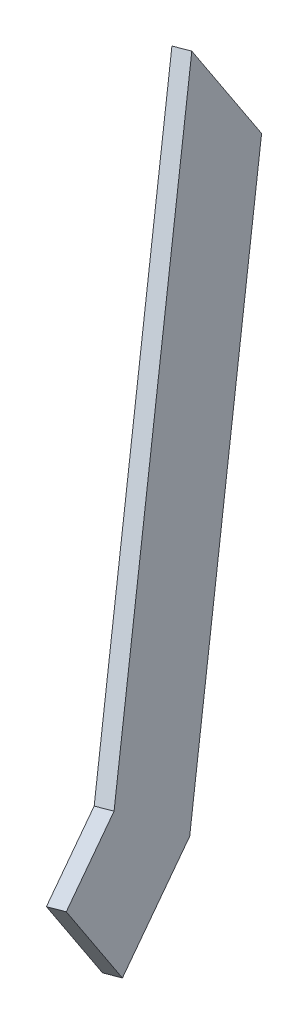
ISO-10303-21;
HEADER;
FILE_DESCRIPTION(('STEP AP214'),'2;1');
FILE_NAME('part.step','',(''),(''),'','','');
FILE_SCHEMA(('AUTOMOTIVE_DESIGN { 1 0 10303 214 1 1 1 1 }'));
ENDSEC;
DATA;
#1=APPLICATION_CONTEXT('core data for automotive mechanical design processes');
#2=APPLICATION_PROTOCOL_DEFINITION('international standard','automotive_design',2000,#1);
#3=PRODUCT_CONTEXT('',#1,'mechanical');
#4=PRODUCT('Part','Part','',(#3));
#5=PRODUCT_RELATED_PRODUCT_CATEGORY('part','',(#4));
#6=PRODUCT_DEFINITION_FORMATION('','',#4);
#7=PRODUCT_DEFINITION_CONTEXT('part definition',#1,'design');
#8=PRODUCT_DEFINITION('design','',#6,#7);
#9=PRODUCT_DEFINITION_SHAPE('','',#8);
#10=(LENGTH_UNIT() NAMED_UNIT(*) SI_UNIT(.MILLI.,.METRE.));
#11=(NAMED_UNIT(*) PLANE_ANGLE_UNIT() SI_UNIT($,.RADIAN.));
#12=(NAMED_UNIT(*) SI_UNIT($,.STERADIAN.) SOLID_ANGLE_UNIT());
#13=UNCERTAINTY_MEASURE_WITH_UNIT(LENGTH_MEASURE(1.E-05),#10,'distance_accuracy_value','');
#14=(GEOMETRIC_REPRESENTATION_CONTEXT(3) GLOBAL_UNCERTAINTY_ASSIGNED_CONTEXT((#13)) GLOBAL_UNIT_ASSIGNED_CONTEXT((#10,
#11,#12)) REPRESENTATION_CONTEXT('',''));
#15=CARTESIAN_POINT('',(0.,0.,0.));
#16=DIRECTION('',(0.,0.,1.));
#17=DIRECTION('',(1.,0.,0.));
#18=AXIS2_PLACEMENT_3D('',#15,#16,#17);
#19=CARTESIAN_POINT('',(66.7296985188487,-421.465841859876,84.5336613124186));
#20=DIRECTION('',(-0.233089191441155,0.534113538308833,-0.812645160588881));
#21=DIRECTION('',(0.,0.835663201942739,0.549242216985193));
#22=AXIS2_PLACEMENT_3D('',#19,#20,#21);
#23=PLANE('',#22);
#24=DIRECTION('',(0.,-0.835663201942739,-0.549242216985192));
#25=VECTOR('',#24,1.);
#26=CARTESIAN_POINT('',(61.8674217146311,-422.105953981189,85.5075816127084));
#27=LINE('',#26,#25);
#28=CARTESIAN_POINT('',(61.8674217146311,-390.937132535845,105.993385644354));
#29=VERTEX_POINT('',#28);
#30=CARTESIAN_POINT('',(61.8674217146311,-422.105953981189,85.5075816127084));
#31=VERTEX_POINT('',#30);
#32=EDGE_CURVE('E118',#29,#31,#27,.T.);
#33=ORIENTED_EDGE('',*,*,#32,.F.);
#34=DIRECTION('',(-0.972455360843524,-0.128022424262425,0.19478406005796));
#35=VECTOR('',#34,1.);
#36=CARTESIAN_POINT('',(66.7296985188487,-390.297020414533,105.019465344064));
#37=LINE('',#36,#35);
#38=CARTESIAN_POINT('',(66.7296985188487,-390.297020414533,105.019465344064));
#39=VERTEX_POINT('',#38);
#40=EDGE_CURVE('E11',#39,#29,#37,.T.);
#41=ORIENTED_EDGE('',*,*,#40,.F.);
#42=DIRECTION('',(0.,-0.835663201942739,-0.549242216985192));
#43=VECTOR('',#42,1.);
#44=CARTESIAN_POINT('',(66.7296985188487,-421.465841859876,84.5336613124186));
#45=LINE('',#44,#43);
#46=CARTESIAN_POINT('',(66.7296985188487,-421.465841859876,84.5336613124186));
#47=VERTEX_POINT('',#46);
#48=EDGE_CURVE('E132',#39,#47,#45,.T.);
#49=ORIENTED_EDGE('',*,*,#48,.T.);
#50=DIRECTION('',(-0.972455360843524,-0.128022424262425,0.19478406005796));
#51=VECTOR('',#50,1.);
#52=CARTESIAN_POINT('',(66.7296985188487,-421.465841859876,84.5336613124186));
#53=LINE('',#52,#51);
#54=EDGE_CURVE('E36',#47,#31,#53,.T.);
#55=ORIENTED_EDGE('',*,*,#54,.T.);
#56=EDGE_LOOP('',(#33,#41,#49,#55));
#57=FACE_BOUND('',#56,.T.);
#58=ADVANCED_FACE('F33',(#57),#23,.T.);
#59=CARTESIAN_POINT('',(66.7296985188487,-390.297020414533,105.019465344064));
#60=DIRECTION('',(0.138498834455911,0.354781776803802,0.92463396200999));
#61=DIRECTION('',(0.,-0.933631747738111,0.358234224517256));
#62=AXIS2_PLACEMENT_3D('',#59,#60,#61);
#63=PLANE('',#62);
#64=DIRECTION('',(-0.187479716292311,0.92614261846322,-0.327278484237882));
#65=VECTOR('',#64,1.);
#66=CARTESIAN_POINT('',(61.8674217146311,-390.937132535845,105.993385644354));
#67=LINE('',#66,#65);
#68=CARTESIAN_POINT('',(92.4731021048298,-542.12802153971,159.420929088871));
#69=VERTEX_POINT('',#68);
#70=EDGE_CURVE('E130',#69,#29,#67,.T.);
#71=ORIENTED_EDGE('',*,*,#70,.F.);
#72=DIRECTION('',(-0.972455360843524,-0.128022424262425,0.19478406005796));
#73=VECTOR('',#72,1.);
#74=CARTESIAN_POINT('',(97.3353789090475,-541.487909418398,158.447008788582));
#75=LINE('',#74,#73);
#76=CARTESIAN_POINT('',(97.3353789090475,-541.487909418398,158.447008788582));
#77=VERTEX_POINT('',#76);
#78=EDGE_CURVE('E42',#77,#69,#75,.T.);
#79=ORIENTED_EDGE('',*,*,#78,.F.);
#80=DIRECTION('',(-0.187479716292311,0.92614261846322,-0.327278484237882));
#81=VECTOR('',#80,1.);
#82=CARTESIAN_POINT('',(66.7296985188487,-390.297020414533,105.019465344064));
#83=LINE('',#82,#81);
#84=EDGE_CURVE('E108',#77,#39,#83,.T.);
#85=ORIENTED_EDGE('',*,*,#84,.T.);
#86=ORIENTED_EDGE('',*,*,#40,.T.);
#87=EDGE_LOOP('',(#71,#79,#85,#86));
#88=FACE_BOUND('',#87,.T.);
#89=ADVANCED_FACE('F140',(#88),#63,.T.);
#90=CARTESIAN_POINT('',(97.3353789090475,-541.487909418398,158.447008788582));
#91=DIRECTION('',(0.,0.835663201942737,0.549242216985195));
#92=DIRECTION('',(0.,-0.549242216985195,0.835663201942737));
#93=AXIS2_PLACEMENT_3D('',#90,#91,#92);
#94=PLANE('',#93);
#95=DIRECTION('',(-0.233089191441155,0.534113538308836,-0.812645160588879));
#96=VECTOR('',#95,1.);
#97=CARTESIAN_POINT('',(92.4731021048298,-542.12802153971,159.420929088871));
#98=LINE('',#97,#96);
#99=CARTESIAN_POINT('',(98.1124932313314,-555.050436044905,179.08217498056));
#100=VERTEX_POINT('',#99);
#101=EDGE_CURVE('E95',#100,#69,#98,.T.);
#102=ORIENTED_EDGE('',*,*,#101,.F.);
#103=DIRECTION('',(-0.972455360843524,-0.128022424262425,0.19478406005796));
#104=VECTOR('',#103,1.);
#105=CARTESIAN_POINT('',(102.974770035549,-554.410323923593,178.10825468027));
#106=LINE('',#105,#104);
#107=CARTESIAN_POINT('',(102.974770035549,-554.410323923593,178.10825468027));
#108=VERTEX_POINT('',#107);
#109=EDGE_CURVE('E90',#108,#100,#106,.T.);
#110=ORIENTED_EDGE('',*,*,#109,.F.);
#111=DIRECTION('',(-0.233089191441155,0.534113538308836,-0.812645160588879));
#112=VECTOR('',#111,1.);
#113=CARTESIAN_POINT('',(97.3353789090475,-541.487909418398,158.447008788582));
#114=LINE('',#113,#112);
#115=EDGE_CURVE('E93',#108,#77,#114,.T.);
#116=ORIENTED_EDGE('',*,*,#115,.T.);
#117=ORIENTED_EDGE('',*,*,#78,.T.);
#118=EDGE_LOOP('',(#102,#110,#116,#117));
#119=FACE_BOUND('',#118,.T.);
#120=ADVANCED_FACE('F92',(#119),#94,.T.);
#121=CARTESIAN_POINT('',(102.974770035549,-579.480219981875,161.630988170714));
#122=DIRECTION('',(0.233089191441155,-0.534113538308833,0.81264516058888));
#123=DIRECTION('',(0.,-0.835663201942738,-0.549242216985193));
#124=AXIS2_PLACEMENT_3D('',#121,#122,#123);
#125=PLANE('',#124);
#126=DIRECTION('',(0.,0.835663201942738,0.549242216985193));
#127=VECTOR('',#126,1.);
#128=CARTESIAN_POINT('',(98.1124932313314,-580.120332103187,162.604908471004));
#129=LINE('',#128,#127);
#130=CARTESIAN_POINT('',(98.1124932313314,-580.120332103187,162.604908471004));
#131=VERTEX_POINT('',#130);
#132=EDGE_CURVE('E127',#131,#100,#129,.T.);
#133=ORIENTED_EDGE('',*,*,#132,.F.);
#134=DIRECTION('',(-0.972455360843524,-0.128022424262425,0.19478406005796));
#135=VECTOR('',#134,1.);
#136=CARTESIAN_POINT('',(102.974770035549,-579.480219981875,161.630988170714));
#137=LINE('',#136,#135);
#138=CARTESIAN_POINT('',(102.974770035549,-579.480219981875,161.630988170714));
#139=VERTEX_POINT('',#138);
#140=EDGE_CURVE('E100',#139,#131,#137,.T.);
#141=ORIENTED_EDGE('',*,*,#140,.F.);
#142=DIRECTION('',(0.,0.835663201942738,0.549242216985193));
#143=VECTOR('',#142,1.);
#144=CARTESIAN_POINT('',(102.974770035549,-579.480219981875,161.630988170714));
#145=LINE('',#144,#143);
#146=EDGE_CURVE('E106',#139,#108,#145,.T.);
#147=ORIENTED_EDGE('',*,*,#146,.T.);
#148=ORIENTED_EDGE('',*,*,#109,.T.);
#149=EDGE_LOOP('',(#133,#141,#147,#148));
#150=FACE_BOUND('',#149,.T.);
#151=ADVANCED_FACE('F110',(#150),#125,.T.);
#152=CARTESIAN_POINT('',(95.0325994539864,-561.281088546638,133.941302313669));
#153=DIRECTION('',(0.,-0.835663201942738,-0.549242216985194));
#154=DIRECTION('',(0.,0.549242216985194,-0.835663201942738));
#155=AXIS2_PLACEMENT_3D('',#152,#153,#154);
#156=PLANE('',#155);
#157=DIRECTION('',(0.233089191441155,-0.534113538308834,0.81264516058888));
#158=VECTOR('',#157,1.);
#159=CARTESIAN_POINT('',(90.1703226497687,-561.92120066795,134.915222613959));
#160=LINE('',#159,#158);
#161=CARTESIAN_POINT('',(90.1703226497687,-561.92120066795,134.915222613959));
#162=VERTEX_POINT('',#161);
#163=EDGE_CURVE('E124',#162,#131,#160,.T.);
#164=ORIENTED_EDGE('',*,*,#163,.F.);
#165=DIRECTION('',(-0.972455360843524,-0.128022424262425,0.19478406005796));
#166=VECTOR('',#165,1.);
#167=CARTESIAN_POINT('',(95.0325994539864,-561.281088546638,133.941302313669));
#168=LINE('',#167,#166);
#169=CARTESIAN_POINT('',(95.0325994539864,-561.281088546638,133.941302313669));
#170=VERTEX_POINT('',#169);
#171=EDGE_CURVE('E135',#170,#162,#168,.T.);
#172=ORIENTED_EDGE('',*,*,#171,.F.);
#173=DIRECTION('',(0.233089191441155,-0.534113538308834,0.81264516058888));
#174=VECTOR('',#173,1.);
#175=CARTESIAN_POINT('',(95.0325994539864,-561.281088546638,133.941302313669));
#176=LINE('',#175,#174);
#177=EDGE_CURVE('E111',#170,#139,#176,.T.);
#178=ORIENTED_EDGE('',*,*,#177,.T.);
#179=ORIENTED_EDGE('',*,*,#140,.T.);
#180=EDGE_LOOP('',(#164,#172,#178,#179));
#181=FACE_BOUND('',#180,.T.);
#182=ADVANCED_FACE('F153',(#181),#156,.T.);
#183=CARTESIAN_POINT('',(66.7296985188487,-421.465841859876,84.5336613124186));
#184=DIRECTION('',(-0.138498834455911,-0.354781776803802,-0.92463396200999));
#185=DIRECTION('',(0.,0.933631747738112,-0.358234224517256));
#186=AXIS2_PLACEMENT_3D('',#183,#184,#185);
#187=PLANE('',#186);
#188=DIRECTION('',(0.187479716292311,-0.92614261846322,0.327278484237882));
#189=VECTOR('',#188,1.);
#190=CARTESIAN_POINT('',(61.8674217146311,-422.105953981189,85.5075816127084));
#191=LINE('',#190,#189);
#192=EDGE_CURVE('E121',#31,#162,#191,.T.);
#193=ORIENTED_EDGE('',*,*,#192,.F.);
#194=ORIENTED_EDGE('',*,*,#54,.F.);
#195=DIRECTION('',(0.187479716292311,-0.92614261846322,0.327278484237882));
#196=VECTOR('',#195,1.);
#197=CARTESIAN_POINT('',(66.7296985188487,-421.465841859876,84.5336613124186));
#198=LINE('',#197,#196);
#199=EDGE_CURVE('E113',#47,#170,#198,.T.);
#200=ORIENTED_EDGE('',*,*,#199,.T.);
#201=ORIENTED_EDGE('',*,*,#171,.T.);
#202=EDGE_LOOP('',(#193,#194,#200,#201));
#203=FACE_BOUND('',#202,.T.);
#204=ADVANCED_FACE('F137',(#203),#187,.T.);
#205=CARTESIAN_POINT('',(-5.37887964185193,-0.70812218153476,1.07739651339288));
#206=DIRECTION('',(0.972455360843524,0.128022424262425,-0.19478406005796));
#207=DIRECTION('',(-0.196400183457513,0.,-0.980523823238301));
#208=AXIS2_PLACEMENT_3D('',#205,#206,#207);
#209=PLANE('',#208);
#210=ORIENTED_EDGE('',*,*,#48,.F.);
#211=ORIENTED_EDGE('',*,*,#84,.F.);
#212=ORIENTED_EDGE('',*,*,#115,.F.);
#213=ORIENTED_EDGE('',*,*,#146,.F.);
#214=ORIENTED_EDGE('',*,*,#177,.F.);
#215=ORIENTED_EDGE('',*,*,#199,.F.);
#216=EDGE_LOOP('',(#210,#211,#212,#213,#214,#215));
#217=FACE_BOUND('',#216,.T.);
#218=ADVANCED_FACE('F104',(#217),#209,.T.);
#219=CARTESIAN_POINT('',(-10.2411564460696,-1.34823430284688,2.05131681368268));
#220=DIRECTION('',(0.972455360843524,0.128022424262425,-0.19478406005796));
#221=DIRECTION('',(-0.196400183457513,0.,-0.980523823238301));
#222=AXIS2_PLACEMENT_3D('',#219,#220,#221);
#223=PLANE('',#222);
#224=ORIENTED_EDGE('',*,*,#32,.T.);
#225=ORIENTED_EDGE('',*,*,#192,.T.);
#226=ORIENTED_EDGE('',*,*,#163,.T.);
#227=ORIENTED_EDGE('',*,*,#132,.T.);
#228=ORIENTED_EDGE('',*,*,#101,.T.);
#229=ORIENTED_EDGE('',*,*,#70,.T.);
#230=EDGE_LOOP('',(#224,#225,#226,#227,#228,#229));
#231=FACE_BOUND('',#230,.T.);
#232=ADVANCED_FACE('F139',(#231),#223,.F.);
#233=CLOSED_SHELL('',(#58,#89,#120,#151,#182,#204,#218,#232));
#234=MANIFOLD_SOLID_BREP('B2',#233);
#235=ADVANCED_BREP_SHAPE_REPRESENTATION('',(#18,#234),#14);
#236=SHAPE_DEFINITION_REPRESENTATION(#9,#235);
ENDSEC;
END-ISO-10303-21;
